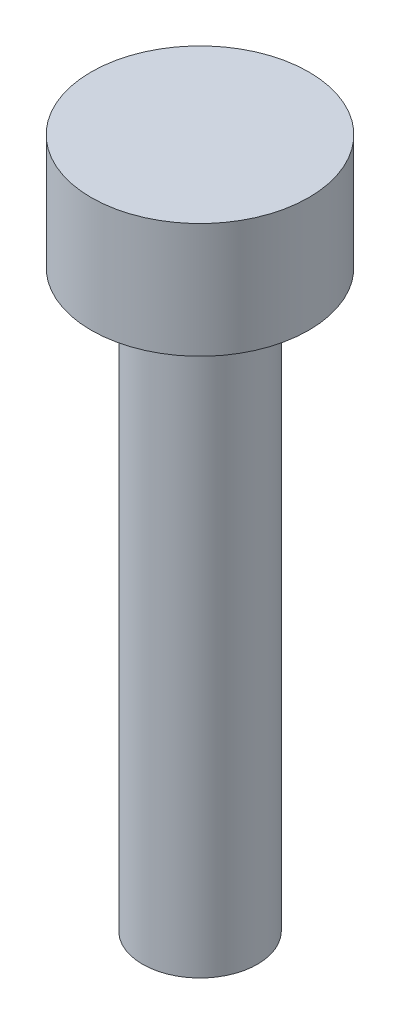
ISO-10303-21;
HEADER;
FILE_DESCRIPTION(('STEP AP214'),'2;1');
FILE_NAME('part.step','',(''),(''),'','','');
FILE_SCHEMA(('AUTOMOTIVE_DESIGN { 1 0 10303 214 1 1 1 1 }'));
ENDSEC;
DATA;
#1=APPLICATION_CONTEXT('core data for automotive mechanical design processes');
#2=APPLICATION_PROTOCOL_DEFINITION('international standard','automotive_design',2000,#1);
#3=PRODUCT_CONTEXT('',#1,'mechanical');
#4=PRODUCT('Part','Part','',(#3));
#5=PRODUCT_RELATED_PRODUCT_CATEGORY('part','',(#4));
#6=PRODUCT_DEFINITION_FORMATION('','',#4);
#7=PRODUCT_DEFINITION_CONTEXT('part definition',#1,'design');
#8=PRODUCT_DEFINITION('design','',#6,#7);
#9=PRODUCT_DEFINITION_SHAPE('','',#8);
#10=(LENGTH_UNIT() NAMED_UNIT(*) SI_UNIT(.MILLI.,.METRE.));
#11=(NAMED_UNIT(*) PLANE_ANGLE_UNIT() SI_UNIT($,.RADIAN.));
#12=(NAMED_UNIT(*) SI_UNIT($,.STERADIAN.) SOLID_ANGLE_UNIT());
#13=UNCERTAINTY_MEASURE_WITH_UNIT(LENGTH_MEASURE(1.E-05),#10,'distance_accuracy_value','');
#14=(GEOMETRIC_REPRESENTATION_CONTEXT(3) GLOBAL_UNCERTAINTY_ASSIGNED_CONTEXT((#13)) GLOBAL_UNIT_ASSIGNED_CONTEXT((#10,
#11,#12)) REPRESENTATION_CONTEXT('',''));
#15=CARTESIAN_POINT('',(0.,0.,0.));
#16=DIRECTION('',(0.,0.,1.));
#17=DIRECTION('',(1.,0.,0.));
#18=AXIS2_PLACEMENT_3D('',#15,#16,#17);
#19=CARTESIAN_POINT('',(0.,15.,0.));
#20=DIRECTION('',(0.,-1.,0.));
#21=DIRECTION('',(0.,0.,-1.));
#22=AXIS2_PLACEMENT_3D('',#19,#20,#21);
#23=CYLINDRICAL_SURFACE('',#22,1.5);
#24=CARTESIAN_POINT('',(0.,15.,0.));
#25=DIRECTION('',(0.,1.,0.));
#26=DIRECTION('',(0.,0.,1.));
#27=AXIS2_PLACEMENT_3D('',#24,#25,#26);
#28=CIRCLE('',#27,1.5);
#29=CARTESIAN_POINT('',(0.,15.,1.5));
#30=VERTEX_POINT('',#29);
#31=EDGE_CURVE('E10',#30,#30,#28,.T.);
#32=ORIENTED_EDGE('',*,*,#31,.F.);
#33=EDGE_LOOP('',(#32));
#34=FACE_BOUND('',#33,.T.);
#35=CARTESIAN_POINT('',(0.,0.,0.));
#36=DIRECTION('',(0.,1.,0.));
#37=DIRECTION('',(0.,0.,1.));
#38=AXIS2_PLACEMENT_3D('',#35,#36,#37);
#39=CIRCLE('',#38,1.5);
#40=CARTESIAN_POINT('',(0.,0.,1.5));
#41=VERTEX_POINT('',#40);
#42=EDGE_CURVE('E34',#41,#41,#39,.T.);
#43=ORIENTED_EDGE('',*,*,#42,.T.);
#44=EDGE_LOOP('',(#43));
#45=FACE_BOUND('',#44,.T.);
#46=ADVANCED_FACE('F31',(#34,#45),#23,.T.);
#47=CARTESIAN_POINT('',(0.,0.,0.));
#48=DIRECTION('',(0.,1.,0.));
#49=DIRECTION('',(0.,0.,1.));
#50=AXIS2_PLACEMENT_3D('',#47,#48,#49);
#51=PLANE('',#50);
#52=ORIENTED_EDGE('',*,*,#42,.F.);
#53=EDGE_LOOP('',(#52));
#54=FACE_BOUND('',#53,.T.);
#55=ADVANCED_FACE('F54',(#54),#51,.F.);
#56=CARTESIAN_POINT('',(0.,18.,0.));
#57=DIRECTION('',(0.,-1.,0.));
#58=DIRECTION('',(0.,0.,-1.));
#59=AXIS2_PLACEMENT_3D('',#56,#57,#58);
#60=CYLINDRICAL_SURFACE('',#59,2.84);
#61=CARTESIAN_POINT('',(0.,18.,0.));
#62=DIRECTION('',(0.,1.,0.));
#63=DIRECTION('',(0.,0.,1.));
#64=AXIS2_PLACEMENT_3D('',#61,#62,#63);
#65=CIRCLE('',#64,2.84);
#66=CARTESIAN_POINT('',(0.,18.,2.84));
#67=VERTEX_POINT('',#66);
#68=EDGE_CURVE('E41',#67,#67,#65,.T.);
#69=ORIENTED_EDGE('',*,*,#68,.F.);
#70=EDGE_LOOP('',(#69));
#71=FACE_BOUND('',#70,.T.);
#72=CARTESIAN_POINT('',(0.,15.,0.));
#73=DIRECTION('',(0.,1.,0.));
#74=DIRECTION('',(0.,0.,1.));
#75=AXIS2_PLACEMENT_3D('',#72,#73,#74);
#76=CIRCLE('',#75,2.84);
#77=CARTESIAN_POINT('',(0.,15.,2.84));
#78=VERTEX_POINT('',#77);
#79=EDGE_CURVE('E43',#78,#78,#76,.T.);
#80=ORIENTED_EDGE('',*,*,#79,.T.);
#81=EDGE_LOOP('',(#80));
#82=FACE_BOUND('',#81,.T.);
#83=ADVANCED_FACE('F51',(#71,#82),#60,.T.);
#84=CARTESIAN_POINT('',(0.,18.,0.));
#85=DIRECTION('',(0.,1.,0.));
#86=DIRECTION('',(0.,0.,1.));
#87=AXIS2_PLACEMENT_3D('',#84,#85,#86);
#88=PLANE('',#87);
#89=ORIENTED_EDGE('',*,*,#68,.T.);
#90=EDGE_LOOP('',(#89));
#91=FACE_BOUND('',#90,.T.);
#92=ADVANCED_FACE('F49',(#91),#88,.T.);
#93=CARTESIAN_POINT('',(0.,15.,0.));
#94=DIRECTION('',(0.,1.,0.));
#95=DIRECTION('',(0.,0.,1.));
#96=AXIS2_PLACEMENT_3D('',#93,#94,#95);
#97=PLANE('',#96);
#98=ORIENTED_EDGE('',*,*,#31,.T.);
#99=EDGE_LOOP('',(#98));
#100=FACE_BOUND('',#99,.T.);
#101=ORIENTED_EDGE('',*,*,#79,.F.);
#102=EDGE_LOOP('',(#101));
#103=FACE_BOUND('',#102,.T.);
#104=ADVANCED_FACE('F58',(#100,#103),#97,.F.);
#105=CLOSED_SHELL('',(#46,#55,#83,#92,#104));
#106=MANIFOLD_SOLID_BREP('B2',#105);
#107=ADVANCED_BREP_SHAPE_REPRESENTATION('',(#18,#106),#14);
#108=SHAPE_DEFINITION_REPRESENTATION(#9,#107);
ENDSEC;
END-ISO-10303-21;
